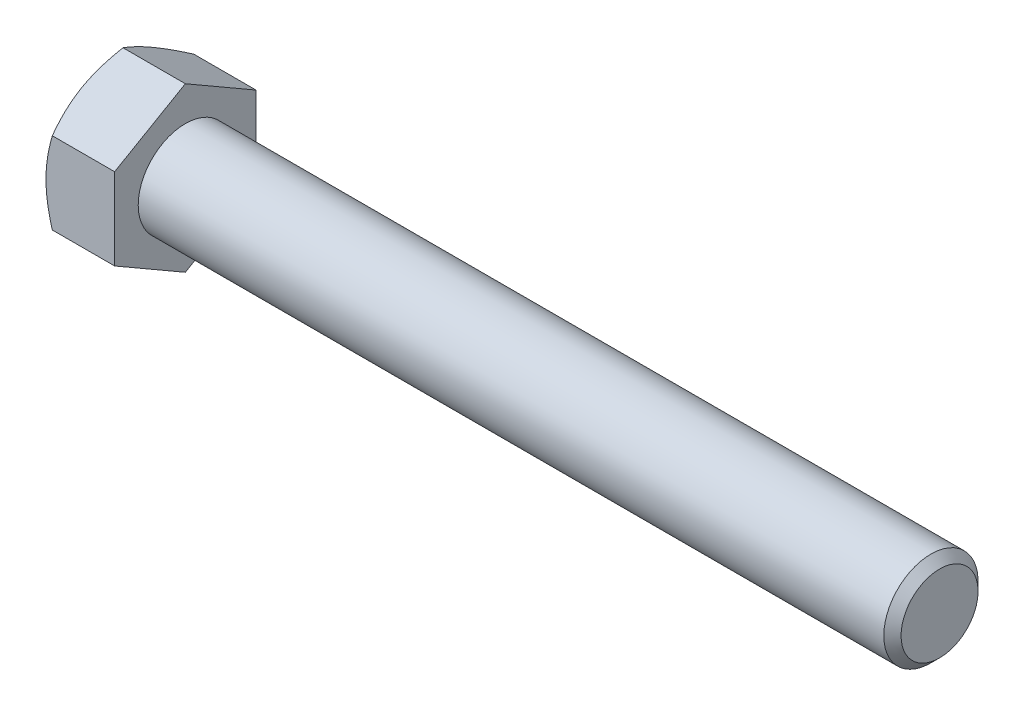
ISO-10303-21;
HEADER;
FILE_DESCRIPTION(('STEP AP214'),'2;1');
FILE_NAME('part.step','',(''),(''),'','','');
FILE_SCHEMA(('AUTOMOTIVE_DESIGN { 1 0 10303 214 1 1 1 1 }'));
ENDSEC;
DATA;
#1=APPLICATION_CONTEXT('core data for automotive mechanical design processes');
#2=APPLICATION_PROTOCOL_DEFINITION('international standard','automotive_design',2000,#1);
#3=PRODUCT_CONTEXT('',#1,'mechanical');
#4=PRODUCT('Part','Part','',(#3));
#5=PRODUCT_RELATED_PRODUCT_CATEGORY('part','',(#4));
#6=PRODUCT_DEFINITION_FORMATION('','',#4);
#7=PRODUCT_DEFINITION_CONTEXT('part definition',#1,'design');
#8=PRODUCT_DEFINITION('design','',#6,#7);
#9=PRODUCT_DEFINITION_SHAPE('','',#8);
#10=(LENGTH_UNIT() NAMED_UNIT(*) SI_UNIT(.MILLI.,.METRE.));
#11=(NAMED_UNIT(*) PLANE_ANGLE_UNIT() SI_UNIT($,.RADIAN.));
#12=(NAMED_UNIT(*) SI_UNIT($,.STERADIAN.) SOLID_ANGLE_UNIT());
#13=UNCERTAINTY_MEASURE_WITH_UNIT(LENGTH_MEASURE(1.E-05),#10,'distance_accuracy_value','');
#14=(GEOMETRIC_REPRESENTATION_CONTEXT(3) GLOBAL_UNCERTAINTY_ASSIGNED_CONTEXT((#13)) GLOBAL_UNIT_ASSIGNED_CONTEXT((#10,
#11,#12)) REPRESENTATION_CONTEXT('',''));
#15=CARTESIAN_POINT('',(0.,0.,0.));
#16=DIRECTION('',(0.,0.,1.));
#17=DIRECTION('',(1.,0.,0.));
#18=AXIS2_PLACEMENT_3D('',#15,#16,#17);
#19=CARTESIAN_POINT('',(9.2456,5.49926131403118,-9.525));
#20=DIRECTION('',(0.,-0.866025403784438,0.5));
#21=DIRECTION('',(0.,-0.5,-0.866025403784438));
#22=AXIS2_PLACEMENT_3D('',#19,#20,#21);
#23=PLANE('',#22);
#24=CARTESIAN_POINT('',(0.850805353685338,10.9986380981162,0.0002));
#25=CARTESIAN_POINT('',(0.781023201247653,10.8777523132173,-0.209180321357812));
#26=CARTESIAN_POINT('',(0.714408233957875,10.7564158029679,-0.419341321922841));
#27=CARTESIAN_POINT('',(0.588391469790024,10.5127697532954,-0.841348659019071));
#28=CARTESIAN_POINT('',(0.528992045309774,10.3904599078574,-1.05319552558363));
#29=CARTESIAN_POINT('',(0.362766604707593,10.0215595864394,-1.69214962520807));
#30=CARTESIAN_POINT('',(0.268218329918823,9.77351282584137,-2.12177921721668));
#31=CARTESIAN_POINT('',(0.15735162884543,9.40232220358294,-2.76470023426138));
#32=CARTESIAN_POINT('',(0.125769866148953,9.28028730086356,-2.97607088606807));
#33=CARTESIAN_POINT('',(0.0728092531292025,9.03565248016183,-3.39979082482397));
#34=CARTESIAN_POINT('',(0.0514305991810304,8.9130525513505,-3.61214013052952));
#35=CARTESIAN_POINT('',(0.0194239766724791,8.66764818787802,-4.03719295646296));
#36=CARTESIAN_POINT('',(0.00878323258549797,8.54484417077186,-4.24989575346439));
#37=CARTESIAN_POINT('',(-0.00152146504907674,8.29912270270345,-4.67549782066928));
#38=CARTESIAN_POINT('',(-0.00118575773535026,8.17620525536319,-4.88839708459929));
#39=CARTESIAN_POINT('',(0.00969884023177905,7.9464080768915,-5.28641747314822));
#40=CARTESIAN_POINT('',(0.0189199445075647,7.83951212670956,-5.4715666899867));
#41=CARTESIAN_POINT('',(0.0454848010115622,7.62597023317657,-5.84143209913029));
#42=CARTESIAN_POINT('',(0.0628291278252527,7.5193243080471,-6.02614825987472));
#43=CARTESIAN_POINT('',(0.126636878025749,7.19979976097279,-6.57958100967287));
#44=CARTESIAN_POINT('',(0.184867121471558,6.98748672019118,-6.94731798341605));
#45=CARTESIAN_POINT('',(0.330443291970775,6.56060850831896,-7.68669273502289));
#46=CARTESIAN_POINT('',(0.418406296346452,6.3460978161353,-8.05823615265176));
#47=CARTESIAN_POINT('',(0.61804579735599,5.92027529884848,-8.79578238759941));
#48=CARTESIAN_POINT('',(0.72967540546015,5.70895802095902,-9.16179464942111));
#49=CARTESIAN_POINT('',(0.850805353685333,5.49914584397735,-9.5252));
#50=B_SPLINE_CURVE_WITH_KNOTS('',3,(#24,#25,#26,#27,#28,#29,#30,#31,#32,#33,#34,#35,#36,#37,#38,
#39,#40,#41,#42,#43,#44,#45,#46,#47,#48,#49),.UNSPECIFIED.,.F.,.F.,(4,2,2,2,2,2,2,2,2,2,2,2,4),
(0.,0.754861746958003,1.50997101692212,3.02340406075151,3.76154608748043,4.49970232035707,
5.23697928598073,5.97423347202914,6.61604550518409,7.25790294292824,8.54252993638602,
9.85564695316764,11.1661863217647),.UNSPECIFIED.);
#51=CARTESIAN_POINT('',(0.850738685968814,10.9985226280624,0.));
#52=VERTEX_POINT('',#51);
#53=CARTESIAN_POINT('',(0.,8.24889197104677,-4.7625));
#54=VERTEX_POINT('',#53);
#55=EDGE_CURVE('E33',#52,#54,#50,.T.);
#56=ORIENTED_EDGE('',*,*,#55,.F.);
#57=DIRECTION('',(-1.,0.,0.));
#58=VECTOR('',#57,1.);
#59=CARTESIAN_POINT('',(9.2456,10.9985226280624,0.));
#60=LINE('',#59,#58);
#61=CARTESIAN_POINT('',(9.2456,10.9985226280624,0.));
#62=VERTEX_POINT('',#61);
#63=EDGE_CURVE('E129',#62,#52,#60,.T.);
#64=ORIENTED_EDGE('',*,*,#63,.F.);
#65=DIRECTION('',(0.,0.5,0.866025403784438));
#66=VECTOR('',#65,1.);
#67=CARTESIAN_POINT('',(9.2456,5.49926131403118,-9.525));
#68=LINE('',#67,#66);
#69=CARTESIAN_POINT('',(9.2456,5.49926131403118,-9.525));
#70=VERTEX_POINT('',#69);
#71=EDGE_CURVE('E214',#70,#62,#68,.T.);
#72=ORIENTED_EDGE('',*,*,#71,.F.);
#73=DIRECTION('',(-1.,0.,0.));
#74=VECTOR('',#73,1.);
#75=CARTESIAN_POINT('',(9.2456,5.49926131403118,-9.525));
#76=LINE('',#75,#74);
#77=CARTESIAN_POINT('',(0.850738685968809,5.49926131403118,-9.525));
#78=VERTEX_POINT('',#77);
#79=EDGE_CURVE('E117',#70,#78,#76,.T.);
#80=ORIENTED_EDGE('',*,*,#79,.T.);
#81=EDGE_CURVE('E111',#54,#78,#50,.T.);
#82=ORIENTED_EDGE('',*,*,#81,.F.);
#83=EDGE_LOOP('',(#56,#64,#72,#80,#82));
#84=FACE_BOUND('',#83,.T.);
#85=ADVANCED_FACE('F17',(#84),#23,.F.);
#86=CARTESIAN_POINT('',(9.2456,10.9985226280624,0.));
#87=DIRECTION('',(0.,-0.866025403784438,-0.5));
#88=DIRECTION('',(0.,0.5,-0.866025403784438));
#89=AXIS2_PLACEMENT_3D('',#86,#87,#88);
#90=PLANE('',#89);
#91=CARTESIAN_POINT('',(0.850805353685332,5.49914584397734,9.5252));
#92=CARTESIAN_POINT('',(0.781023201247651,5.62003162887629,9.31581967864219));
#93=CARTESIAN_POINT('',(0.714408233957875,5.74136813912568,9.10565867807716));
#94=CARTESIAN_POINT('',(0.588391469790027,5.98501418879818,8.68365134098093));
#95=CARTESIAN_POINT('',(0.528992045309778,6.10732403423621,8.47180447441637));
#96=CARTESIAN_POINT('',(0.362766604707597,6.47622435565419,7.83285037479193));
#97=CARTESIAN_POINT('',(0.268218329918826,6.72427111625219,7.40322078278332));
#98=CARTESIAN_POINT('',(0.157351628845433,7.09546173851062,6.76029976573862));
#99=CARTESIAN_POINT('',(0.125769866148957,7.21749664123,6.54892911393193));
#100=CARTESIAN_POINT('',(0.072809253129207,7.46213146193173,6.12520917517604));
#101=CARTESIAN_POINT('',(0.0514305991810352,7.58473139074305,5.91285986947049));
#102=CARTESIAN_POINT('',(0.0194239766724854,7.83013575421554,5.48780704353704));
#103=CARTESIAN_POINT('',(0.00878323258550545,7.9529397713217,5.27510424653562));
#104=CARTESIAN_POINT('',(-0.00152146504907275,8.19866123939011,4.84950217933072));
#105=CARTESIAN_POINT('',(-0.00118575773535089,8.32157868673037,4.63660291540071));
#106=CARTESIAN_POINT('',(0.0096988402317796,8.55137586520205,4.23858252685178));
#107=CARTESIAN_POINT('',(0.0189199445075698,8.658271815384,4.05343331001331));
#108=CARTESIAN_POINT('',(0.0454848010115701,8.87181370891699,3.68356790086972));
#109=CARTESIAN_POINT('',(0.0628291278252588,8.97845963404646,3.49885174012528));
#110=CARTESIAN_POINT('',(0.126636878025753,9.29798418112077,2.94541899032714));
#111=CARTESIAN_POINT('',(0.184867121471563,9.51029722190237,2.57768201658396));
#112=CARTESIAN_POINT('',(0.330443291970782,9.9371754337746,1.83830726497711));
#113=CARTESIAN_POINT('',(0.418406296346458,10.1516861259583,1.46676384734825));
#114=CARTESIAN_POINT('',(0.618045797355996,10.5775086432451,0.729217612400587));
#115=CARTESIAN_POINT('',(0.729675405460156,10.7888259211345,0.363205350578887));
#116=CARTESIAN_POINT('',(0.850805353685338,10.9986380981162,-0.000199999999998275));
#117=B_SPLINE_CURVE_WITH_KNOTS('',3,(#91,#92,#93,#94,#95,#96,#97,#98,#99,#100,#101,#102,#103,
#104,#105,#106,#107,#108,#109,#110,#111,#112,#113,#114,#115,#116),.UNSPECIFIED.,.F.,.F.,(4,2,2,
2,2,2,2,2,2,2,2,2,4),(0.,0.754861746958003,1.50997101692211,3.02340406075151,3.76154608748042,
4.49970232035706,5.23697928598071,5.97423347202913,6.61604550518408,7.25790294292823,
8.54252993638602,9.85564695316764,11.1661863217647),.UNSPECIFIED.);
#118=CARTESIAN_POINT('',(0.850738685968808,5.49926131403118,9.525));
#119=VERTEX_POINT('',#118);
#120=CARTESIAN_POINT('',(0.,8.24889197104677,4.7625));
#121=VERTEX_POINT('',#120);
#122=EDGE_CURVE('E40',#119,#121,#117,.T.);
#123=ORIENTED_EDGE('',*,*,#122,.F.);
#124=DIRECTION('',(-1.,0.,0.));
#125=VECTOR('',#124,1.);
#126=CARTESIAN_POINT('',(9.2456,5.49926131403118,9.525));
#127=LINE('',#126,#125);
#128=CARTESIAN_POINT('',(9.2456,5.49926131403118,9.525));
#129=VERTEX_POINT('',#128);
#130=EDGE_CURVE('E127',#129,#119,#127,.T.);
#131=ORIENTED_EDGE('',*,*,#130,.F.);
#132=DIRECTION('',(0.,-0.5,0.866025403784438));
#133=VECTOR('',#132,1.);
#134=CARTESIAN_POINT('',(9.2456,10.9985226280624,0.));
#135=LINE('',#134,#133);
#136=EDGE_CURVE('E212',#62,#129,#135,.T.);
#137=ORIENTED_EDGE('',*,*,#136,.F.);
#138=ORIENTED_EDGE('',*,*,#63,.T.);
#139=EDGE_CURVE('E144',#121,#52,#117,.T.);
#140=ORIENTED_EDGE('',*,*,#139,.F.);
#141=EDGE_LOOP('',(#123,#131,#137,#138,#140));
#142=FACE_BOUND('',#141,.T.);
#143=ADVANCED_FACE('F150',(#142),#90,.F.);
#144=CARTESIAN_POINT('',(9.2456,5.49926131403118,9.525));
#145=DIRECTION('',(0.,0.,-1.));
#146=DIRECTION('',(-1.,0.,0.));
#147=AXIS2_PLACEMENT_3D('',#144,#145,#146);
#148=PLANE('',#147);
#149=CARTESIAN_POINT('',(4.65297862020099,-14.7810115366526,9.525));
#150=CARTESIAN_POINT('',(4.55200114697973,-14.5729402848548,9.525));
#151=CARTESIAN_POINT('',(4.45152657852499,-14.3646250845143,9.525));
#152=CARTESIAN_POINT('',(4.25169715270384,-13.9474558848886,9.525));
#153=CARTESIAN_POINT('',(4.15234230655458,-13.7386018802315,9.525));
#154=CARTESIAN_POINT('',(3.85610205085236,-13.1110997604408,9.525));
#155=CARTESIAN_POINT('',(3.66107082946321,-12.6915729928092,9.525));
#156=CARTESIAN_POINT('',(3.27608312845875,-11.8474364819289,9.525));
#157=CARTESIAN_POINT('',(3.08615996520331,-11.422811507093,9.525));
#158=CARTESIAN_POINT('',(2.71407238167633,-10.5701875182868,9.525));
#159=CARTESIAN_POINT('',(2.53190759510787,-10.1421886647409,9.525));
#160=CARTESIAN_POINT('',(2.17173180421229,-9.26840827793761,9.525));
#161=CARTESIAN_POINT('',(1.99403865760542,-8.82249500065038,9.525));
#162=CARTESIAN_POINT('',(1.65207801715253,-7.92545654404829,9.525));
#163=CARTESIAN_POINT('',(1.48781202814777,-7.47433078699667,9.525));
#164=CARTESIAN_POINT('',(1.17701101312695,-6.56698486643262,9.525));
#165=CARTESIAN_POINT('',(1.03044020737989,-6.11077709183234,9.525));
#166=CARTESIAN_POINT('',(0.759723980462397,-5.19183461770945,9.525));
#167=CARTESIAN_POINT('',(0.635571508908766,-4.72910201971934,9.525));
#168=CARTESIAN_POINT('',(0.416296039044826,-3.79927533749824,9.525));
#169=CARTESIAN_POINT('',(0.321019170056997,-3.33221854628568,9.525));
#170=CARTESIAN_POINT('',(0.20389532745602,-2.62737339603033,9.525));
#171=CARTESIAN_POINT('',(0.169151073901594,-2.39169815065082,9.525));
#172=CARTESIAN_POINT('',(0.108940898325768,-1.91917305353182,9.525));
#173=CARTESIAN_POINT('',(0.0834740799106719,-1.68232331751526,9.525));
#174=CARTESIAN_POINT('',(0.042646213938291,-1.21086692666171,9.525));
#175=CARTESIAN_POINT('',(0.0271575476697079,-0.97627136721609,9.525));
#176=CARTESIAN_POINT('',(0.00611497588533352,-0.506635508477943,9.525));
#177=CARTESIAN_POINT('',(0.000560905150695157,-0.271595216646689,9.525));
#178=CARTESIAN_POINT('',(-0.000479967131791086,0.198511625361337,9.525));
#179=CARTESIAN_POINT('',(0.00403333600034571,0.433578175785731,9.525));
#180=CARTESIAN_POINT('',(0.0230169602197957,0.903311845567773,9.525));
#181=CARTESIAN_POINT('',(0.0374877771856481,1.13797894444949,9.525));
#182=CARTESIAN_POINT('',(0.08389260023287,1.70156520102241,9.525));
#183=CARTESIAN_POINT('',(0.120529196491429,2.03010533257162,9.525));
#184=CARTESIAN_POINT('',(0.211324091565228,2.68473880457707,9.525));
#185=CARTESIAN_POINT('',(0.265484757377358,3.01083180840529,9.525));
#186=CARTESIAN_POINT('',(0.451380100896853,3.98506326209962,9.525));
#187=CARTESIAN_POINT('',(0.606495020219102,4.62879899939554,9.525));
#188=CARTESIAN_POINT('',(0.875429330956875,5.59158230732313,9.525));
#189=CARTESIAN_POINT('',(0.972405254059029,5.91562142468819,9.525));
#190=CARTESIAN_POINT('',(1.1764087393435,6.56055109397583,9.525));
#191=CARTESIAN_POINT('',(1.28343637307408,6.88144162346874,9.525));
#192=CARTESIAN_POINT('',(1.50582732440541,7.52017825999874,9.525));
#193=CARTESIAN_POINT('',(1.62118794476215,7.83802531476306,9.525));
#194=CARTESIAN_POINT('',(1.85888923263679,8.47108431720179,9.525));
#195=CARTESIAN_POINT('',(1.98122977973553,8.78629631022933,9.525));
#196=CARTESIAN_POINT('',(2.30063477459309,9.58716274310341,9.525));
#197=CARTESIAN_POINT('',(2.5017818490006,10.0711868007296,9.525));
#198=CARTESIAN_POINT('',(2.91473175900993,11.0346830906918,9.525));
#199=CARTESIAN_POINT('',(3.12653548923491,11.5141549368409,9.525));
#200=CARTESIAN_POINT('',(3.55844219486128,12.4695072075479,9.525));
#201=CARTESIAN_POINT('',(3.77854763045354,12.9453865165195,9.525));
#202=CARTESIAN_POINT('',(4.22520690131799,13.8940827737157,9.525));
#203=CARTESIAN_POINT('',(4.45176054207863,14.3668998137873,9.525));
#204=CARTESIAN_POINT('',(4.91030379081788,15.31066754278,9.525));
#205=CARTESIAN_POINT('',(5.14230026383006,15.7816148898186,9.525));
#206=CARTESIAN_POINT('',(5.61043419198851,16.7214473380242,9.525));
#207=CARTESIAN_POINT('',(5.84657167244608,17.190332426564,9.525));
#208=CARTESIAN_POINT('',(6.32217781208354,18.1263065899709,9.525));
#209=CARTESIAN_POINT('',(6.56164589066584,18.5933959601917,9.525));
#210=CARTESIAN_POINT('',(7.04336394052911,19.5261387749102,9.525));
#211=CARTESIAN_POINT('',(7.28561392258589,19.9917922138368,9.525));
#212=CARTESIAN_POINT('',(7.96929589667508,21.2980525732429,9.525));
#213=CARTESIAN_POINT('',(8.41334550528856,22.137289288128,9.525));
#214=CARTESIAN_POINT('',(9.30698696570738,23.81285124024,9.525));
#215=CARTESIAN_POINT('',(9.75657908064913,24.6491763367986,9.525));
#216=CARTESIAN_POINT('',(10.6586387715906,26.3171534675353,9.525));
#217=CARTESIAN_POINT('',(11.1110942984919,27.1488120222569,9.525));
#218=CARTESIAN_POINT('',(11.7921739160347,28.394953533384,9.525));
#219=CARTESIAN_POINT('',(12.0195924712892,28.8100962856008,9.525));
#220=CARTESIAN_POINT('',(12.4751463020887,29.6399876727052,9.525));
#221=CARTESIAN_POINT('',(12.7032815766791,30.0547363081167,9.525));
#222=CARTESIAN_POINT('',(12.9317320980144,30.4693112732241,9.525));
#223=B_SPLINE_CURVE_WITH_KNOTS('',3,(#149,#150,#151,#152,#153,#154,#155,#156,#157,#158,#159,
#160,#161,#162,#163,#164,#165,#166,#167,#168,#169,#170,#171,#172,#173,#174,#175,#176,#177,#178,
#179,#180,#181,#182,#183,#184,#185,#186,#187,#188,#189,#190,#191,#192,#193,#194,#195,#196,#197,
#198,#199,#200,#201,#202,#203,#204,#205,#206,#207,#208,#209,#210,#211,#212,#213,#214,#215,#216,
#217,#218,#219,#220,#221,#222),.UNSPECIFIED.,.F.,.F.,(4,2,2,2,2,2,2,2,2,2,2,2,2,2,2,2,2,2,2,2,2,
2,2,2,2,2,2,2,2,2,2,2,2,2,2,2,4),(0.,0.693836530044209,1.38768000463458,2.77557197297935,
4.17100213114403,5.56636633354268,7.00624082823087,8.44627647542748,9.88334978435084,
11.3199703553044,12.748795200913,13.4633089947651,14.1777537333629,14.882869257303,
15.5879730545998,16.2930841835603,16.9982304291964,17.9894005549206,18.9807046150987,
20.9643780182785,21.979010564481,22.9936503334043,24.0079631400216,25.0222584527869,
26.5945433127102,28.1669603864418,29.7398471611297,31.3126865395143,32.8876294963395,
34.4625820831342,36.0372634785706,37.6119509756548,40.4603369594249,43.3088586981742,
46.1491565485713,47.569213896597,48.9892693539118),.UNSPECIFIED.);
#224=CARTESIAN_POINT('',(0.850738685968814,-5.4992613140312,9.525));
#225=VERTEX_POINT('',#224);
#226=CARTESIAN_POINT('',(0.,0.,9.525));
#227=VERTEX_POINT('',#226);
#228=EDGE_CURVE('E224',#225,#227,#223,.T.);
#229=ORIENTED_EDGE('',*,*,#228,.F.);
#230=DIRECTION('',(-1.,0.,0.));
#231=VECTOR('',#230,1.);
#232=CARTESIAN_POINT('',(9.2456,-5.4992613140312,9.525));
#233=LINE('',#232,#231);
#234=CARTESIAN_POINT('',(9.2456,-5.4992613140312,9.525));
#235=VERTEX_POINT('',#234);
#236=EDGE_CURVE('E119',#235,#225,#233,.T.);
#237=ORIENTED_EDGE('',*,*,#236,.F.);
#238=DIRECTION('',(0.,-1.,0.));
#239=VECTOR('',#238,1.);
#240=CARTESIAN_POINT('',(9.2456,5.49926131403118,9.525));
#241=LINE('',#240,#239);
#242=EDGE_CURVE('E208',#129,#235,#241,.T.);
#243=ORIENTED_EDGE('',*,*,#242,.F.);
#244=ORIENTED_EDGE('',*,*,#130,.T.);
#245=EDGE_CURVE('E166',#227,#119,#223,.T.);
#246=ORIENTED_EDGE('',*,*,#245,.F.);
#247=EDGE_LOOP('',(#229,#237,#243,#244,#246));
#248=FACE_BOUND('',#247,.T.);
#249=ADVANCED_FACE('F230',(#248),#148,.F.);
#250=CARTESIAN_POINT('',(9.2456,-10.9985226280624,0.));
#251=DIRECTION('',(0.,0.866025403784438,-0.5));
#252=DIRECTION('',(0.,0.5,0.866025403784438));
#253=AXIS2_PLACEMENT_3D('',#250,#251,#252);
#254=PLANE('',#253);
#255=CARTESIAN_POINT('',(0.850805353685348,-10.9986380981162,-0.000200000000000014));
#256=CARTESIAN_POINT('',(0.781023201247665,-10.8777523132173,0.209180321357821));
#257=CARTESIAN_POINT('',(0.714408233957888,-10.7564158029679,0.419341321922854));
#258=CARTESIAN_POINT('',(0.588391469790038,-10.5127697532954,0.841348659019086));
#259=CARTESIAN_POINT('',(0.528992045309787,-10.3904599078574,1.05319552558364));
#260=CARTESIAN_POINT('',(0.362766604707606,-10.0215595864394,1.69214962520808));
#261=CARTESIAN_POINT('',(0.268218329918837,-9.77351282584139,2.12177921721669));
#262=CARTESIAN_POINT('',(0.157351628845444,-9.40232220358296,2.76470023426139));
#263=CARTESIAN_POINT('',(0.125769866148967,-9.28028730086358,2.97607088606808));
#264=CARTESIAN_POINT('',(0.072809253129217,-9.03565248016185,3.39979082482398));
#265=CARTESIAN_POINT('',(0.0514305991810449,-8.91305255135052,3.61214013052953));
#266=CARTESIAN_POINT('',(0.0194239766724946,-8.66764818787804,4.03719295646297));
#267=CARTESIAN_POINT('',(0.00878323258551464,-8.54484417077188,4.2498957534644));
#268=CARTESIAN_POINT('',(-0.0015214650490644,-8.29912270270347,4.67549782066929));
#269=CARTESIAN_POINT('',(-0.00118575773534333,-8.17620525536321,4.8883970845993));
#270=CARTESIAN_POINT('',(0.0096988402317875,-7.94640807689152,5.28641747314823));
#271=CARTESIAN_POINT('',(0.0189199445075785,-7.83951212670958,5.47156668998671));
#272=CARTESIAN_POINT('',(0.0454848010115793,-7.6259702331766,5.8414320991303));
#273=CARTESIAN_POINT('',(0.0628291278252677,-7.51932430804712,6.02614825987473));
#274=CARTESIAN_POINT('',(0.126636878025761,-7.19979976097281,6.57958100967287));
#275=CARTESIAN_POINT('',(0.184867121471571,-6.98748672019121,6.94731798341606));
#276=CARTESIAN_POINT('',(0.330443291970789,-6.56060850831899,7.68669273502289));
#277=CARTESIAN_POINT('',(0.418406296346464,-6.34609781613533,8.05823615265176));
#278=CARTESIAN_POINT('',(0.618045797356,-5.9202752988485,8.79578238759942));
#279=CARTESIAN_POINT('',(0.729675405460158,-5.70895802095904,9.16179464942112));
#280=CARTESIAN_POINT('',(0.850805353685338,-5.49914584397736,9.5252));
#281=B_SPLINE_CURVE_WITH_KNOTS('',3,(#255,#256,#257,#258,#259,#260,#261,#262,#263,#264,#265,
#266,#267,#268,#269,#270,#271,#272,#273,#274,#275,#276,#277,#278,#279,#280),.UNSPECIFIED.,.F.,
.F.,(4,2,2,2,2,2,2,2,2,2,2,2,4),(0.,0.754861746958003,1.50997101692212,3.02340406075151,
3.76154608748043,4.49970232035707,5.23697928598072,5.97423347202913,6.61604550518408,
7.25790294292824,8.54252993638601,9.85564695316763,11.1661863217647),.UNSPECIFIED.);
#282=CARTESIAN_POINT('',(0.850738685968824,-10.9985226280624,0.));
#283=VERTEX_POINT('',#282);
#284=CARTESIAN_POINT('',(0.,-8.24889197104677,4.7625));
#285=VERTEX_POINT('',#284);
#286=EDGE_CURVE('E152',#283,#285,#281,.T.);
#287=ORIENTED_EDGE('',*,*,#286,.F.);
#288=DIRECTION('',(-1.,0.,0.));
#289=VECTOR('',#288,1.);
#290=CARTESIAN_POINT('',(9.2456,-10.9985226280624,0.));
#291=LINE('',#290,#289);
#292=CARTESIAN_POINT('',(9.2456,-10.9985226280624,0.));
#293=VERTEX_POINT('',#292);
#294=EDGE_CURVE('E116',#293,#283,#291,.T.);
#295=ORIENTED_EDGE('',*,*,#294,.F.);
#296=DIRECTION('',(0.,-0.5,-0.866025403784438));
#297=VECTOR('',#296,1.);
#298=CARTESIAN_POINT('',(9.2456,-10.9985226280624,0.));
#299=LINE('',#298,#297);
#300=EDGE_CURVE('E206',#235,#293,#299,.T.);
#301=ORIENTED_EDGE('',*,*,#300,.F.);
#302=ORIENTED_EDGE('',*,*,#236,.T.);
#303=EDGE_CURVE('E154',#285,#225,#281,.T.);
#304=ORIENTED_EDGE('',*,*,#303,.F.);
#305=EDGE_LOOP('',(#287,#295,#301,#302,#304));
#306=FACE_BOUND('',#305,.T.);
#307=ADVANCED_FACE('F202',(#306),#254,.F.);
#308=CARTESIAN_POINT('',(9.2456,-5.4992613140312,-9.525));
#309=DIRECTION('',(0.,0.866025403784438,0.5));
#310=DIRECTION('',(0.,-0.5,0.866025403784438));
#311=AXIS2_PLACEMENT_3D('',#308,#309,#310);
#312=PLANE('',#311);
#313=CARTESIAN_POINT('',(0.850805353685337,-5.49914584397736,-9.5252));
#314=CARTESIAN_POINT('',(0.781023201247654,-5.62003162887631,-9.31581967864218));
#315=CARTESIAN_POINT('',(0.714408233957877,-5.74136813912569,-9.10565867807715));
#316=CARTESIAN_POINT('',(0.588391469790028,-5.9850141887982,-8.68365134098092));
#317=CARTESIAN_POINT('',(0.528992045309779,-6.10732403423622,-8.47180447441636));
#318=CARTESIAN_POINT('',(0.362766604707599,-6.47622435565421,-7.83285037479192));
#319=CARTESIAN_POINT('',(0.26821832991883,-6.72427111625221,-7.40322078278332));
#320=CARTESIAN_POINT('',(0.157351628845437,-7.09546173851063,-6.76029976573861));
#321=CARTESIAN_POINT('',(0.12576986614896,-7.21749664123001,-6.54892911393193));
#322=CARTESIAN_POINT('',(0.0728092531292097,-7.46213146193174,-6.12520917517603));
#323=CARTESIAN_POINT('',(0.0514305991810382,-7.58473139074307,-5.91285986947048));
#324=CARTESIAN_POINT('',(0.0194239766724886,-7.83013575421556,-5.48780704353703));
#325=CARTESIAN_POINT('',(0.00878323258550868,-7.95293977132171,-5.27510424653561));
#326=CARTESIAN_POINT('',(-0.00152146504906692,-8.19866123939012,-4.84950217933072));
#327=CARTESIAN_POINT('',(-0.00118575773534252,-8.32157868673039,-4.63660291540071));
#328=CARTESIAN_POINT('',(0.00969884023178729,-8.55137586520207,-4.23858252685178));
#329=CARTESIAN_POINT('',(0.0189199445075749,-8.65827181538401,-4.0534333100133));
#330=CARTESIAN_POINT('',(0.045484801011574,-8.871813708917,-3.68356790086971));
#331=CARTESIAN_POINT('',(0.0628291278252642,-8.97845963404647,-3.49885174012527));
#332=CARTESIAN_POINT('',(0.12663687802576,-9.29798418112078,-2.94541899032713));
#333=CARTESIAN_POINT('',(0.18486712147157,-9.51029722190239,-2.57768201658395));
#334=CARTESIAN_POINT('',(0.330443291970788,-9.93717543377461,-1.83830726497711));
#335=CARTESIAN_POINT('',(0.418406296346464,-10.1516861259583,-1.46676384734825));
#336=CARTESIAN_POINT('',(0.618045797356003,-10.5775086432451,-0.729217612400588));
#337=CARTESIAN_POINT('',(0.729675405460164,-10.7888259211346,-0.363205350578887));
#338=CARTESIAN_POINT('',(0.850805353685348,-10.9986380981162,0.000199999999999516));
#339=B_SPLINE_CURVE_WITH_KNOTS('',3,(#313,#314,#315,#316,#317,#318,#319,#320,#321,#322,#323,
#324,#325,#326,#327,#328,#329,#330,#331,#332,#333,#334,#335,#336,#337,#338),.UNSPECIFIED.,.F.,
.F.,(4,2,2,2,2,2,2,2,2,2,2,2,4),(0.,0.754861746958005,1.50997101692212,3.02340406075151,
3.76154608748042,4.49970232035707,5.23697928598072,5.97423347202913,6.61604550518408,
7.25790294292824,8.54252993638601,9.85564695316763,11.1661863217647),.UNSPECIFIED.);
#340=CARTESIAN_POINT('',(0.850738685968812,-5.4992613140312,-9.525));
#341=VERTEX_POINT('',#340);
#342=CARTESIAN_POINT('',(0.,-8.24889197104677,-4.7625));
#343=VERTEX_POINT('',#342);
#344=EDGE_CURVE('E93',#341,#343,#339,.T.);
#345=ORIENTED_EDGE('',*,*,#344,.F.);
#346=DIRECTION('',(-1.,0.,0.));
#347=VECTOR('',#346,1.);
#348=CARTESIAN_POINT('',(9.2456,-5.4992613140312,-9.525));
#349=LINE('',#348,#347);
#350=CARTESIAN_POINT('',(9.2456,-5.4992613140312,-9.525));
#351=VERTEX_POINT('',#350);
#352=EDGE_CURVE('E107',#351,#341,#349,.T.);
#353=ORIENTED_EDGE('',*,*,#352,.F.);
#354=DIRECTION('',(0.,0.5,-0.866025403784438));
#355=VECTOR('',#354,1.);
#356=CARTESIAN_POINT('',(9.2456,-5.4992613140312,-9.525));
#357=LINE('',#356,#355);
#358=EDGE_CURVE('E204',#293,#351,#357,.T.);
#359=ORIENTED_EDGE('',*,*,#358,.F.);
#360=ORIENTED_EDGE('',*,*,#294,.T.);
#361=EDGE_CURVE('E110',#343,#283,#339,.T.);
#362=ORIENTED_EDGE('',*,*,#361,.F.);
#363=EDGE_LOOP('',(#345,#353,#359,#360,#362));
#364=FACE_BOUND('',#363,.T.);
#365=ADVANCED_FACE('F105',(#364),#312,.F.);
#366=CARTESIAN_POINT('',(9.2456,5.49926131403118,-9.525));
#367=DIRECTION('',(0.,0.,1.));
#368=DIRECTION('',(1.,0.,0.));
#369=AXIS2_PLACEMENT_3D('',#366,#367,#368);
#370=PLANE('',#369);
#371=CARTESIAN_POINT('',(4.65297862020099,-14.7810115366526,-9.525));
#372=CARTESIAN_POINT('',(4.55200114697973,-14.5729402848548,-9.525));
#373=CARTESIAN_POINT('',(4.45152657852499,-14.3646250845143,-9.525));
#374=CARTESIAN_POINT('',(4.25169715270384,-13.9474558848886,-9.525));
#375=CARTESIAN_POINT('',(4.15234230655458,-13.7386018802315,-9.525));
#376=CARTESIAN_POINT('',(3.85610205085236,-13.1110997604408,-9.525));
#377=CARTESIAN_POINT('',(3.66107082946321,-12.6915729928092,-9.525));
#378=CARTESIAN_POINT('',(3.27608312845875,-11.8474364819289,-9.525));
#379=CARTESIAN_POINT('',(3.08615996520331,-11.4228115070931,-9.525));
#380=CARTESIAN_POINT('',(2.71407238167633,-10.5701875182868,-9.525));
#381=CARTESIAN_POINT('',(2.53190759510787,-10.1421886647409,-9.525));
#382=CARTESIAN_POINT('',(2.17173180421229,-9.26840827793761,-9.525));
#383=CARTESIAN_POINT('',(1.99403865760542,-8.82249500065038,-9.525));
#384=CARTESIAN_POINT('',(1.65207801715253,-7.92545654404828,-9.525));
#385=CARTESIAN_POINT('',(1.48781202814776,-7.47433078699666,-9.525));
#386=CARTESIAN_POINT('',(1.17701101312695,-6.56698486643261,-9.525));
#387=CARTESIAN_POINT('',(1.03044020737989,-6.11077709183233,-9.525));
#388=CARTESIAN_POINT('',(0.759723980462396,-5.19183461770945,-9.525));
#389=CARTESIAN_POINT('',(0.635571508908765,-4.72910201971934,-9.525));
#390=CARTESIAN_POINT('',(0.416296039044825,-3.79927533749824,-9.525));
#391=CARTESIAN_POINT('',(0.321019170056995,-3.33221854628568,-9.525));
#392=CARTESIAN_POINT('',(0.20389532745602,-2.62737339603033,-9.525));
#393=CARTESIAN_POINT('',(0.169151073901594,-2.39169815065082,-9.525));
#394=CARTESIAN_POINT('',(0.108940898325768,-1.91917305353182,-9.525));
#395=CARTESIAN_POINT('',(0.0834740799106709,-1.68232331751525,-9.525));
#396=CARTESIAN_POINT('',(0.04264621393829,-1.21086692666171,-9.525));
#397=CARTESIAN_POINT('',(0.0271575476697076,-0.976271367216086,-9.525));
#398=CARTESIAN_POINT('',(0.00611497588533376,-0.50663550847794,-9.525));
#399=CARTESIAN_POINT('',(0.000560905150695041,-0.271595216646686,-9.525));
#400=CARTESIAN_POINT('',(-0.000479967131790972,0.19851162536134,-9.525));
#401=CARTESIAN_POINT('',(0.00403333600034645,0.433578175785734,-9.525));
#402=CARTESIAN_POINT('',(0.023016960219797,0.903311845567775,-9.525));
#403=CARTESIAN_POINT('',(0.0374877771856492,1.1379789444495,-9.525));
#404=CARTESIAN_POINT('',(0.083892600232871,1.70156520102242,-9.525));
#405=CARTESIAN_POINT('',(0.12052919649143,2.03010533257162,-9.525));
#406=CARTESIAN_POINT('',(0.211324091565229,2.68473880457707,-9.525));
#407=CARTESIAN_POINT('',(0.265484757377358,3.01083180840529,-9.525));
#408=CARTESIAN_POINT('',(0.451380100896853,3.98506326209962,-9.525));
#409=CARTESIAN_POINT('',(0.606495020219103,4.62879899939554,-9.525));
#410=CARTESIAN_POINT('',(0.875429330956877,5.59158230732314,-9.525));
#411=CARTESIAN_POINT('',(0.972405254059032,5.9156214246882,-9.525));
#412=CARTESIAN_POINT('',(1.1764087393435,6.56055109397584,-9.525));
#413=CARTESIAN_POINT('',(1.28343637307408,6.88144162346875,-9.525));
#414=CARTESIAN_POINT('',(1.50582732440542,7.52017825999875,-9.525));
#415=CARTESIAN_POINT('',(1.62118794476215,7.83802531476308,-9.525));
#416=CARTESIAN_POINT('',(1.8588892326368,8.4710843172018,-9.525));
#417=CARTESIAN_POINT('',(1.98122977973553,8.78629631022934,-9.525));
#418=CARTESIAN_POINT('',(2.30063477459309,9.58716274310342,-9.525));
#419=CARTESIAN_POINT('',(2.5017818490006,10.0711868007297,-9.525));
#420=CARTESIAN_POINT('',(2.91473175900994,11.0346830906918,-9.525));
#421=CARTESIAN_POINT('',(3.12653548923492,11.514154936841,-9.525));
#422=CARTESIAN_POINT('',(3.55844219486128,12.4695072075479,-9.525));
#423=CARTESIAN_POINT('',(3.77854763045354,12.9453865165195,-9.525));
#424=CARTESIAN_POINT('',(4.225206901318,13.8940827737157,-9.525));
#425=CARTESIAN_POINT('',(4.45176054207864,14.3668998137873,-9.525));
#426=CARTESIAN_POINT('',(4.91030379081789,15.31066754278,-9.525));
#427=CARTESIAN_POINT('',(5.14230026383007,15.7816148898186,-9.525));
#428=CARTESIAN_POINT('',(5.61043419198852,16.7214473380242,-9.525));
#429=CARTESIAN_POINT('',(5.84657167244609,17.190332426564,-9.525));
#430=CARTESIAN_POINT('',(6.32217781208355,18.1263065899709,-9.525));
#431=CARTESIAN_POINT('',(6.56164589066585,18.5933959601918,-9.525));
#432=CARTESIAN_POINT('',(7.04336394052912,19.5261387749102,-9.525));
#433=CARTESIAN_POINT('',(7.2856139225859,19.9917922138368,-9.525));
#434=CARTESIAN_POINT('',(7.96929589667509,21.2980525732429,-9.525));
#435=CARTESIAN_POINT('',(8.41334550528857,22.137289288128,-9.525));
#436=CARTESIAN_POINT('',(9.30698696570739,23.81285124024,-9.525));
#437=CARTESIAN_POINT('',(9.75657908064913,24.6491763367986,-9.525));
#438=CARTESIAN_POINT('',(10.6586387715906,26.3171534675353,-9.525));
#439=CARTESIAN_POINT('',(11.111094298492,27.1488120222569,-9.525));
#440=CARTESIAN_POINT('',(11.7921739160347,28.394953533384,-9.525));
#441=CARTESIAN_POINT('',(12.0195924712892,28.8100962856008,-9.525));
#442=CARTESIAN_POINT('',(12.4751463020887,29.6399876727052,-9.525));
#443=CARTESIAN_POINT('',(12.7032815766791,30.0547363081167,-9.525));
#444=CARTESIAN_POINT('',(12.9317320980145,30.4693112732241,-9.525));
#445=B_SPLINE_CURVE_WITH_KNOTS('',3,(#371,#372,#373,#374,#375,#376,#377,#378,#379,#380,#381,
#382,#383,#384,#385,#386,#387,#388,#389,#390,#391,#392,#393,#394,#395,#396,#397,#398,#399,#400,
#401,#402,#403,#404,#405,#406,#407,#408,#409,#410,#411,#412,#413,#414,#415,#416,#417,#418,#419,
#420,#421,#422,#423,#424,#425,#426,#427,#428,#429,#430,#431,#432,#433,#434,#435,#436,#437,#438,
#439,#440,#441,#442,#443,#444),.UNSPECIFIED.,.F.,.F.,(4,2,2,2,2,2,2,2,2,2,2,2,2,2,2,2,2,2,2,2,2,
2,2,2,2,2,2,2,2,2,2,2,2,2,2,2,4),(0.,0.693836530044205,1.38768000463458,2.77557197297935,
4.17100213114403,5.56636633354268,7.00624082823087,8.44627647542748,9.88334978435085,
11.3199703553044,12.748795200913,13.4633089947651,14.1777537333629,14.882869257303,
15.5879730545998,16.2930841835603,16.9982304291963,17.9894005549206,18.9807046150986,
20.9643780182785,21.979010564481,22.9936503334043,24.0079631400216,25.0222584527869,
26.5945433127102,28.1669603864418,29.7398471611297,31.3126865395143,32.8876294963396,
34.4625820831342,36.0372634785707,37.6119509756548,40.4603369594249,43.3088586981742,
46.1491565485713,47.569213896597,48.9892693539118),.UNSPECIFIED.);
#446=CARTESIAN_POINT('',(0.,0.,-9.525));
#447=VERTEX_POINT('',#446);
#448=EDGE_CURVE('E99',#78,#447,#445,.F.);
#449=ORIENTED_EDGE('',*,*,#448,.F.);
#450=ORIENTED_EDGE('',*,*,#79,.F.);
#451=DIRECTION('',(0.,1.,0.));
#452=VECTOR('',#451,1.);
#453=CARTESIAN_POINT('',(9.2456,5.49926131403118,-9.525));
#454=LINE('',#453,#452);
#455=EDGE_CURVE('E115',#351,#70,#454,.T.);
#456=ORIENTED_EDGE('',*,*,#455,.F.);
#457=ORIENTED_EDGE('',*,*,#352,.T.);
#458=EDGE_CURVE('E90',#447,#341,#445,.F.);
#459=ORIENTED_EDGE('',*,*,#458,.F.);
#460=EDGE_LOOP('',(#449,#450,#456,#457,#459));
#461=FACE_BOUND('',#460,.T.);
#462=ADVANCED_FACE('F113',(#461),#370,.F.);
#463=CARTESIAN_POINT('',(9.2456,10.9985226280624,0.));
#464=DIRECTION('',(1.,0.,0.));
#465=DIRECTION('',(0.,0.,-1.));
#466=AXIS2_PLACEMENT_3D('',#463,#464,#465);
#467=PLANE('',#466);
#468=ORIENTED_EDGE('',*,*,#71,.T.);
#469=ORIENTED_EDGE('',*,*,#136,.T.);
#470=ORIENTED_EDGE('',*,*,#242,.T.);
#471=ORIENTED_EDGE('',*,*,#300,.T.);
#472=ORIENTED_EDGE('',*,*,#358,.T.);
#473=ORIENTED_EDGE('',*,*,#455,.T.);
#474=EDGE_LOOP('',(#468,#469,#470,#471,#472,#473));
#475=FACE_BOUND('',#474,.T.);
#476=CARTESIAN_POINT('',(9.2456,0.,0.));
#477=DIRECTION('',(1.,0.,0.));
#478=DIRECTION('',(0.,0.,-1.));
#479=AXIS2_PLACEMENT_3D('',#476,#477,#478);
#480=CIRCLE('',#479,6.35);
#481=CARTESIAN_POINT('',(9.2456,0.,-6.35));
#482=VERTEX_POINT('',#481);
#483=EDGE_CURVE('E217',#482,#482,#480,.F.);
#484=ORIENTED_EDGE('',*,*,#483,.T.);
#485=EDGE_LOOP('',(#484));
#486=FACE_BOUND('',#485,.T.);
#487=ADVANCED_FACE('F232',(#475,#486),#467,.T.);
#488=CARTESIAN_POINT('',(0.,0.,0.));
#489=DIRECTION('',(-1.,0.,0.));
#490=DIRECTION('',(0.,0.,1.));
#491=AXIS2_PLACEMENT_3D('',#488,#489,#490);
#492=CYLINDRICAL_SURFACE('',#491,6.35);
#493=ORIENTED_EDGE('',*,*,#483,.F.);
#494=EDGE_LOOP('',(#493));
#495=FACE_BOUND('',#494,.T.);
#496=CARTESIAN_POINT('',(109.68228,0.,0.));
#497=DIRECTION('',(-1.,0.,0.));
#498=DIRECTION('',(0.,0.,1.));
#499=AXIS2_PLACEMENT_3D('',#496,#497,#498);
#500=CIRCLE('',#499,6.35);
#501=CARTESIAN_POINT('',(109.68228,0.,6.35));
#502=VERTEX_POINT('',#501);
#503=EDGE_CURVE('E220',#502,#502,#500,.T.);
#504=ORIENTED_EDGE('',*,*,#503,.T.);
#505=EDGE_LOOP('',(#504));
#506=FACE_BOUND('',#505,.T.);
#507=ADVANCED_FACE('F269',(#495,#506),#492,.T.);
#508=CARTESIAN_POINT('',(110.8456,0.,0.));
#509=DIRECTION('',(-1.,0.,0.));
#510=DIRECTION('',(0.,0.,1.));
#511=AXIS2_PLACEMENT_3D('',#508,#509,#510);
#512=CONICAL_SURFACE('',#511,5.18668,0.785398163397438);
#513=ORIENTED_EDGE('',*,*,#503,.F.);
#514=EDGE_LOOP('',(#513));
#515=FACE_BOUND('',#514,.T.);
#516=CARTESIAN_POINT('',(110.8456,0.,0.));
#517=DIRECTION('',(-1.,0.,0.));
#518=DIRECTION('',(0.,0.,1.));
#519=AXIS2_PLACEMENT_3D('',#516,#517,#518);
#520=CIRCLE('',#519,5.18668);
#521=CARTESIAN_POINT('',(110.8456,0.,5.18668));
#522=VERTEX_POINT('',#521);
#523=EDGE_CURVE('E222',#522,#522,#520,.T.);
#524=ORIENTED_EDGE('',*,*,#523,.T.);
#525=EDGE_LOOP('',(#524));
#526=FACE_BOUND('',#525,.T.);
#527=ADVANCED_FACE('F271',(#515,#526),#512,.T.);
#528=CARTESIAN_POINT('',(110.8456,0.,0.));
#529=DIRECTION('',(-1.,0.,0.));
#530=DIRECTION('',(0.,0.,1.));
#531=AXIS2_PLACEMENT_3D('',#528,#529,#530);
#532=PLANE('',#531);
#533=ORIENTED_EDGE('',*,*,#523,.F.);
#534=EDGE_LOOP('',(#533));
#535=FACE_BOUND('',#534,.T.);
#536=ADVANCED_FACE('F179',(#535),#532,.F.);
#537=CARTESIAN_POINT('',(0.,0.,0.));
#538=DIRECTION('',(1.,0.,0.));
#539=DIRECTION('',(0.,0.,-1.));
#540=AXIS2_PLACEMENT_3D('',#537,#538,#539);
#541=CONICAL_SURFACE('',#540,9.525,1.0471975511966);
#542=ORIENTED_EDGE('',*,*,#344,.T.);
#543=CARTESIAN_POINT('',(0.,0.,0.));
#544=DIRECTION('',(1.,0.,0.));
#545=DIRECTION('',(0.,0.,-1.));
#546=AXIS2_PLACEMENT_3D('',#543,#544,#545);
#547=CIRCLE('',#546,9.525);
#548=EDGE_CURVE('E21',#343,#447,#547,.T.);
#549=ORIENTED_EDGE('',*,*,#548,.T.);
#550=ORIENTED_EDGE('',*,*,#458,.T.);
#551=EDGE_LOOP('',(#542,#549,#550));
#552=FACE_BOUND('',#551,.T.);
#553=ADVANCED_FACE('F92',(#552),#541,.T.);
#554=ORIENTED_EDGE('',*,*,#286,.T.);
#555=EDGE_CURVE('E134',#285,#343,#547,.T.);
#556=ORIENTED_EDGE('',*,*,#555,.T.);
#557=ORIENTED_EDGE('',*,*,#361,.T.);
#558=EDGE_LOOP('',(#554,#556,#557));
#559=FACE_BOUND('',#558,.T.);
#560=ADVANCED_FACE('F178',(#559),#541,.T.);
#561=ORIENTED_EDGE('',*,*,#228,.T.);
#562=EDGE_CURVE('E135',#227,#285,#547,.T.);
#563=ORIENTED_EDGE('',*,*,#562,.T.);
#564=ORIENTED_EDGE('',*,*,#303,.T.);
#565=EDGE_LOOP('',(#561,#563,#564));
#566=FACE_BOUND('',#565,.T.);
#567=ADVANCED_FACE('F173',(#566),#541,.T.);
#568=ORIENTED_EDGE('',*,*,#245,.T.);
#569=ORIENTED_EDGE('',*,*,#122,.T.);
#570=CARTESIAN_POINT('',(0.,0.,0.));
#571=DIRECTION('',(-1.,0.,0.));
#572=DIRECTION('',(0.,0.,1.));
#573=AXIS2_PLACEMENT_3D('',#570,#571,#572);
#574=CIRCLE('',#573,9.525);
#575=EDGE_CURVE('E100',#227,#121,#574,.T.);
#576=ORIENTED_EDGE('',*,*,#575,.F.);
#577=EDGE_LOOP('',(#568,#569,#576));
#578=FACE_BOUND('',#577,.T.);
#579=ADVANCED_FACE('F177',(#578),#541,.T.);
#580=ORIENTED_EDGE('',*,*,#139,.T.);
#581=ORIENTED_EDGE('',*,*,#55,.T.);
#582=EDGE_CURVE('E26',#54,#121,#547,.T.);
#583=ORIENTED_EDGE('',*,*,#582,.T.);
#584=EDGE_LOOP('',(#580,#581,#583));
#585=FACE_BOUND('',#584,.T.);
#586=ADVANCED_FACE('F143',(#585),#541,.T.);
#587=ORIENTED_EDGE('',*,*,#81,.T.);
#588=ORIENTED_EDGE('',*,*,#448,.T.);
#589=EDGE_CURVE('E11',#447,#54,#547,.T.);
#590=ORIENTED_EDGE('',*,*,#589,.T.);
#591=EDGE_LOOP('',(#587,#588,#590));
#592=FACE_BOUND('',#591,.T.);
#593=ADVANCED_FACE('F236',(#592),#541,.T.);
#594=CARTESIAN_POINT('',(0.,10.9985226280624,0.));
#595=DIRECTION('',(1.,0.,0.));
#596=DIRECTION('',(0.,0.,-1.));
#597=AXIS2_PLACEMENT_3D('',#594,#595,#596);
#598=PLANE('',#597);
#599=ORIENTED_EDGE('',*,*,#589,.F.);
#600=ORIENTED_EDGE('',*,*,#548,.F.);
#601=ORIENTED_EDGE('',*,*,#555,.F.);
#602=ORIENTED_EDGE('',*,*,#562,.F.);
#603=ORIENTED_EDGE('',*,*,#575,.T.);
#604=ORIENTED_EDGE('',*,*,#582,.F.);
#605=EDGE_LOOP('',(#599,#600,#601,#602,#603,#604));
#606=FACE_BOUND('',#605,.T.);
#607=ADVANCED_FACE('F147',(#606),#598,.F.);
#608=CLOSED_SHELL('',(#85,#143,#249,#307,#365,#462,#487,#507,#527,#536,#553,#560,#567,#579,#586,
#593,#607));
#609=MANIFOLD_SOLID_BREP('B1',#608);
#610=ADVANCED_BREP_SHAPE_REPRESENTATION('',(#18,#609),#14);
#611=SHAPE_DEFINITION_REPRESENTATION(#9,#610);
ENDSEC;
END-ISO-10303-21;
